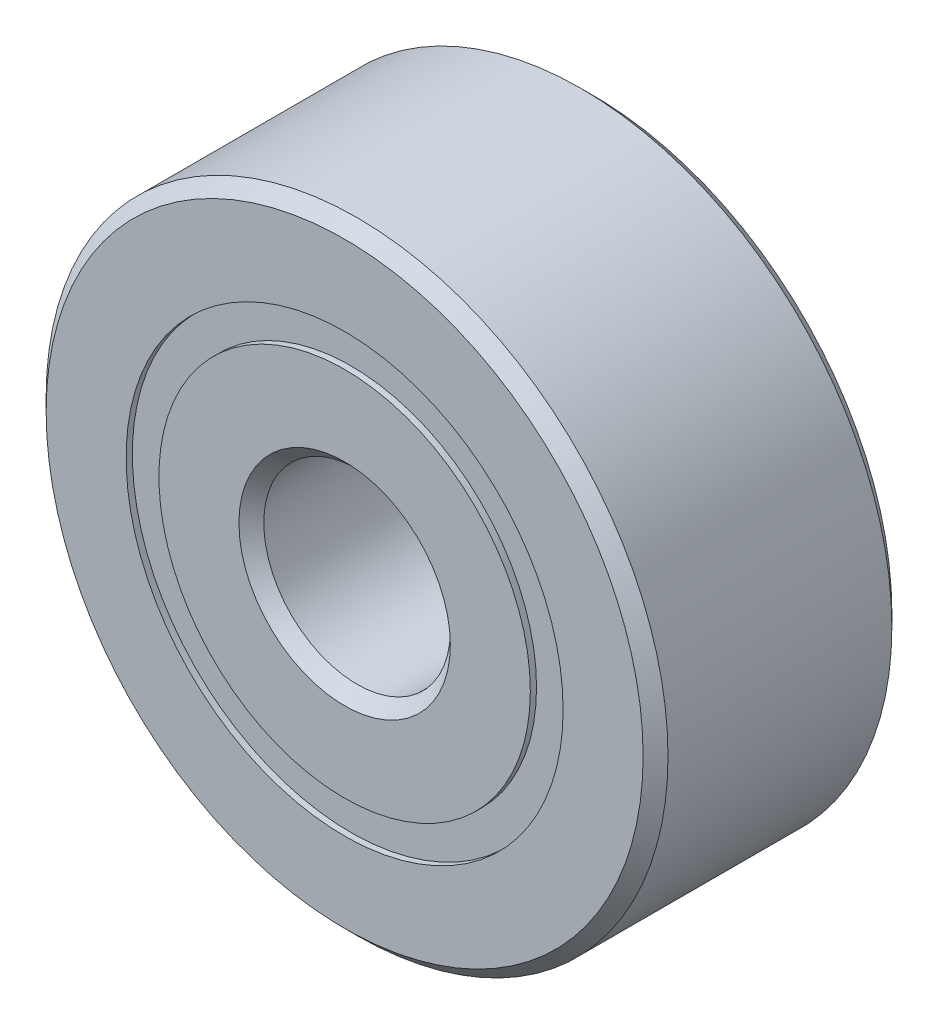
ISO-10303-21;
HEADER;
FILE_DESCRIPTION(('STEP AP214'),'2;1');
FILE_NAME('part.step','',(''),(''),'','','');
FILE_SCHEMA(('AUTOMOTIVE_DESIGN { 1 0 10303 214 1 1 1 1 }'));
ENDSEC;
DATA;
#1=APPLICATION_CONTEXT('core data for automotive mechanical design processes');
#2=APPLICATION_PROTOCOL_DEFINITION('international standard','automotive_design',2000,#1);
#3=PRODUCT_CONTEXT('',#1,'mechanical');
#4=PRODUCT('Part','Part','',(#3));
#5=PRODUCT_RELATED_PRODUCT_CATEGORY('part','',(#4));
#6=PRODUCT_DEFINITION_FORMATION('','',#4);
#7=PRODUCT_DEFINITION_CONTEXT('part definition',#1,'design');
#8=PRODUCT_DEFINITION('design','',#6,#7);
#9=PRODUCT_DEFINITION_SHAPE('','',#8);
#10=(LENGTH_UNIT() NAMED_UNIT(*) SI_UNIT(.MILLI.,.METRE.));
#11=(NAMED_UNIT(*) PLANE_ANGLE_UNIT() SI_UNIT($,.RADIAN.));
#12=(NAMED_UNIT(*) SI_UNIT($,.STERADIAN.) SOLID_ANGLE_UNIT());
#13=UNCERTAINTY_MEASURE_WITH_UNIT(LENGTH_MEASURE(1.E-05),#10,'distance_accuracy_value','');
#14=(GEOMETRIC_REPRESENTATION_CONTEXT(3) GLOBAL_UNCERTAINTY_ASSIGNED_CONTEXT((#13)) GLOBAL_UNIT_ASSIGNED_CONTEXT((#10,
#11,#12)) REPRESENTATION_CONTEXT('',''));
#15=CARTESIAN_POINT('',(0.,0.,0.));
#16=DIRECTION('',(0.,0.,1.));
#17=DIRECTION('',(1.,0.,0.));
#18=AXIS2_PLACEMENT_3D('',#15,#16,#17);
#19=CARTESIAN_POINT('',(0.,3.51373626373626,-1.9));
#20=DIRECTION('',(0.,0.,1.));
#21=DIRECTION('',(1.,0.,0.));
#22=AXIS2_PLACEMENT_3D('',#19,#20,#21);
#23=PLANE('',#22);
#24=CARTESIAN_POINT('',(0.,0.,-1.9));
#25=DIRECTION('',(0.,0.,1.));
#26=DIRECTION('',(1.,0.,0.));
#27=AXIS2_PLACEMENT_3D('',#24,#25,#26);
#28=CIRCLE('',#27,3.51373626373626);
#29=CARTESIAN_POINT('',(3.51373626373626,0.,-1.9));
#30=VERTEX_POINT('',#29);
#31=EDGE_CURVE('E61',#30,#30,#28,.T.);
#32=ORIENTED_EDGE('',*,*,#31,.F.);
#33=EDGE_LOOP('',(#32));
#34=FACE_BOUND('',#33,.T.);
#35=CARTESIAN_POINT('',(0.,0.,-1.9));
#36=DIRECTION('',(0.,0.,1.));
#37=DIRECTION('',(1.,0.,0.));
#38=AXIS2_PLACEMENT_3D('',#35,#36,#37);
#39=CIRCLE('',#38,2.98626373626374);
#40=CARTESIAN_POINT('',(2.98626373626374,0.,-1.9));
#41=VERTEX_POINT('',#40);
#42=EDGE_CURVE('E11',#41,#41,#39,.T.);
#43=ORIENTED_EDGE('',*,*,#42,.T.);
#44=EDGE_LOOP('',(#43));
#45=FACE_BOUND('',#44,.T.);
#46=ADVANCED_FACE('F47',(#34,#45),#23,.F.);
#47=CARTESIAN_POINT('',(0.,0.,2.));
#48=DIRECTION('',(0.,0.,1.));
#49=DIRECTION('',(1.,0.,0.));
#50=AXIS2_PLACEMENT_3D('',#47,#48,#49);
#51=CYLINDRICAL_SURFACE('',#50,2.98626373626374);
#52=ORIENTED_EDGE('',*,*,#42,.F.);
#53=EDGE_LOOP('',(#52));
#54=FACE_BOUND('',#53,.T.);
#55=CARTESIAN_POINT('',(0.,0.,-0.927189448602436));
#56=DIRECTION('',(0.,0.,1.));
#57=DIRECTION('',(1.,0.,0.));
#58=AXIS2_PLACEMENT_3D('',#55,#56,#57);
#59=CIRCLE('',#58,2.98626373626374);
#60=CARTESIAN_POINT('',(2.98626373626374,0.,-0.927189448602436));
#61=VERTEX_POINT('',#60);
#62=EDGE_CURVE('E53',#61,#61,#59,.T.);
#63=ORIENTED_EDGE('',*,*,#62,.T.);
#64=EDGE_LOOP('',(#63));
#65=FACE_BOUND('',#64,.T.);
#66=ADVANCED_FACE('F70',(#54,#65),#51,.F.);
#67=CARTESIAN_POINT('',(0.,3.51373626373626,-0.927189448602435));
#68=DIRECTION('',(0.,0.,-1.));
#69=DIRECTION('',(-1.,0.,0.));
#70=AXIS2_PLACEMENT_3D('',#67,#68,#69);
#71=PLANE('',#70);
#72=ORIENTED_EDGE('',*,*,#62,.F.);
#73=EDGE_LOOP('',(#72));
#74=FACE_BOUND('',#73,.T.);
#75=CARTESIAN_POINT('',(0.,0.,-0.927189448602436));
#76=DIRECTION('',(0.,0.,1.));
#77=DIRECTION('',(1.,0.,0.));
#78=AXIS2_PLACEMENT_3D('',#75,#76,#77);
#79=CIRCLE('',#78,3.51373626373626);
#80=CARTESIAN_POINT('',(3.51373626373626,0.,-0.927189448602436));
#81=VERTEX_POINT('',#80);
#82=EDGE_CURVE('E57',#81,#81,#79,.T.);
#83=ORIENTED_EDGE('',*,*,#82,.T.);
#84=EDGE_LOOP('',(#83));
#85=FACE_BOUND('',#84,.T.);
#86=ADVANCED_FACE('F74',(#74,#85),#71,.F.);
#87=CARTESIAN_POINT('',(0.,0.,2.));
#88=DIRECTION('',(0.,0.,1.));
#89=DIRECTION('',(1.,0.,0.));
#90=AXIS2_PLACEMENT_3D('',#87,#88,#89);
#91=CYLINDRICAL_SURFACE('',#90,3.51373626373626);
#92=ORIENTED_EDGE('',*,*,#82,.F.);
#93=EDGE_LOOP('',(#92));
#94=FACE_BOUND('',#93,.T.);
#95=ORIENTED_EDGE('',*,*,#31,.T.);
#96=EDGE_LOOP('',(#95));
#97=FACE_BOUND('',#96,.T.);
#98=ADVANCED_FACE('F67',(#94,#97),#91,.T.);
#99=CLOSED_SHELL('',(#46,#66,#86,#98));
#100=MANIFOLD_SOLID_BREP('B2',#99);
#101=CARTESIAN_POINT('',(0.,3.51373626373626,1.9));
#102=DIRECTION('',(0.,0.,-1.));
#103=DIRECTION('',(-1.,0.,0.));
#104=AXIS2_PLACEMENT_3D('',#101,#102,#103);
#105=PLANE('',#104);
#106=CARTESIAN_POINT('',(0.,0.,1.9));
#107=DIRECTION('',(0.,0.,1.));
#108=DIRECTION('',(1.,0.,0.));
#109=AXIS2_PLACEMENT_3D('',#106,#107,#108);
#110=CIRCLE('',#109,2.98626373626374);
#111=CARTESIAN_POINT('',(2.98626373626374,0.,1.9));
#112=VERTEX_POINT('',#111);
#113=EDGE_CURVE('E46',#112,#112,#110,.T.);
#114=ORIENTED_EDGE('',*,*,#113,.F.);
#115=EDGE_LOOP('',(#114));
#116=FACE_BOUND('',#115,.T.);
#117=CARTESIAN_POINT('',(0.,0.,1.9));
#118=DIRECTION('',(0.,0.,1.));
#119=DIRECTION('',(1.,0.,0.));
#120=AXIS2_PLACEMENT_3D('',#117,#118,#119);
#121=CIRCLE('',#120,3.51373626373626);
#122=CARTESIAN_POINT('',(3.51373626373626,0.,1.9));
#123=VERTEX_POINT('',#122);
#124=EDGE_CURVE('E136',#123,#123,#121,.T.);
#125=ORIENTED_EDGE('',*,*,#124,.T.);
#126=EDGE_LOOP('',(#125));
#127=FACE_BOUND('',#126,.T.);
#128=ADVANCED_FACE('F122',(#116,#127),#105,.F.);
#129=CARTESIAN_POINT('',(0.,0.,2.));
#130=DIRECTION('',(0.,0.,1.));
#131=DIRECTION('',(1.,0.,0.));
#132=AXIS2_PLACEMENT_3D('',#129,#130,#131);
#133=CYLINDRICAL_SURFACE('',#132,2.98626373626374);
#134=CARTESIAN_POINT('',(0.,0.,0.927189448602434));
#135=DIRECTION('',(0.,0.,1.));
#136=DIRECTION('',(1.,0.,0.));
#137=AXIS2_PLACEMENT_3D('',#134,#135,#136);
#138=CIRCLE('',#137,2.98626373626374);
#139=CARTESIAN_POINT('',(2.98626373626374,0.,0.927189448602434));
#140=VERTEX_POINT('',#139);
#141=EDGE_CURVE('E128',#140,#140,#138,.T.);
#142=ORIENTED_EDGE('',*,*,#141,.F.);
#143=EDGE_LOOP('',(#142));
#144=FACE_BOUND('',#143,.T.);
#145=ORIENTED_EDGE('',*,*,#113,.T.);
#146=EDGE_LOOP('',(#145));
#147=FACE_BOUND('',#146,.T.);
#148=ADVANCED_FACE('F151',(#144,#147),#133,.F.);
#149=CARTESIAN_POINT('',(0.,3.51373626373626,0.927189448602434));
#150=DIRECTION('',(0.,0.,1.));
#151=DIRECTION('',(1.,0.,0.));
#152=AXIS2_PLACEMENT_3D('',#149,#150,#151);
#153=PLANE('',#152);
#154=CARTESIAN_POINT('',(0.,0.,0.927189448602434));
#155=DIRECTION('',(0.,0.,1.));
#156=DIRECTION('',(1.,0.,0.));
#157=AXIS2_PLACEMENT_3D('',#154,#155,#156);
#158=CIRCLE('',#157,3.51373626373626);
#159=CARTESIAN_POINT('',(3.51373626373626,0.,0.927189448602434));
#160=VERTEX_POINT('',#159);
#161=EDGE_CURVE('E132',#160,#160,#158,.T.);
#162=ORIENTED_EDGE('',*,*,#161,.F.);
#163=EDGE_LOOP('',(#162));
#164=FACE_BOUND('',#163,.T.);
#165=ORIENTED_EDGE('',*,*,#141,.T.);
#166=EDGE_LOOP('',(#165));
#167=FACE_BOUND('',#166,.T.);
#168=ADVANCED_FACE('F146',(#164,#167),#153,.F.);
#169=CARTESIAN_POINT('',(0.,0.,2.));
#170=DIRECTION('',(0.,0.,1.));
#171=DIRECTION('',(1.,0.,0.));
#172=AXIS2_PLACEMENT_3D('',#169,#170,#171);
#173=CYLINDRICAL_SURFACE('',#172,3.51373626373626);
#174=ORIENTED_EDGE('',*,*,#124,.F.);
#175=EDGE_LOOP('',(#174));
#176=FACE_BOUND('',#175,.T.);
#177=ORIENTED_EDGE('',*,*,#161,.T.);
#178=EDGE_LOOP('',(#177));
#179=FACE_BOUND('',#178,.T.);
#180=ADVANCED_FACE('F143',(#176,#179),#173,.T.);
#181=CLOSED_SHELL('',(#128,#148,#168,#180));
#182=MANIFOLD_SOLID_BREP('B6',#181);
#183=CARTESIAN_POINT('',(-1.62499999999996,2.81458256229945,0.));
#184=DIRECTION('',(0.,0.,1.));
#185=DIRECTION('',(-0.499999999999989,0.866025403784445,0.));
#186=AXIS2_PLACEMENT_3D('',#183,#184,#185);
#187=SPHERICAL_SURFACE('',#186,0.927189448602435);
#188=CARTESIAN_POINT('',(-1.62499999999996,2.81458256229945,0.927189448602434));
#189=VERTEX_POINT('',#188);
#190=VERTEX_LOOP('',#189);
#191=FACE_BOUND('',#190,.T.);
#192=ADVANCED_FACE('F197',(#191),#187,.T.);
#193=CLOSED_SHELL('',(#192));
#194=MANIFOLD_SOLID_BREP('B41',#193);
#195=CARTESIAN_POINT('',(-2.81458256229941,1.62500000000003,0.));
#196=DIRECTION('',(0.,0.,1.));
#197=DIRECTION('',(-0.866025403784433,0.50000000000001,0.));
#198=AXIS2_PLACEMENT_3D('',#195,#196,#197);
#199=SPHERICAL_SURFACE('',#198,0.927189448602435);
#200=CARTESIAN_POINT('',(-2.81458256229941,1.62500000000003,0.927189448602434));
#201=VERTEX_POINT('',#200);
#202=VERTEX_LOOP('',#201);
#203=FACE_BOUND('',#202,.T.);
#204=ADVANCED_FACE('F219',(#203),#199,.T.);
#205=CLOSED_SHELL('',(#204));
#206=MANIFOLD_SOLID_BREP('B118',#205);
#207=CARTESIAN_POINT('',(-3.25,0.,0.));
#208=DIRECTION('',(0.,0.,1.));
#209=DIRECTION('',(-1.,0.,0.));
#210=AXIS2_PLACEMENT_3D('',#207,#208,#209);
#211=SPHERICAL_SURFACE('',#210,0.927189448602435);
#212=CARTESIAN_POINT('',(-3.25,0.,0.927189448602434));
#213=VERTEX_POINT('',#212);
#214=VERTEX_LOOP('',#213);
#215=FACE_BOUND('',#214,.T.);
#216=ADVANCED_FACE('F241',(#215),#211,.T.);
#217=CLOSED_SHELL('',(#216));
#218=MANIFOLD_SOLID_BREP('B193',#217);
#219=CARTESIAN_POINT('',(-2.81458256229944,-1.62499999999997,0.));
#220=DIRECTION('',(0.,0.,1.));
#221=DIRECTION('',(-0.866025403784443,-0.499999999999992,0.));
#222=AXIS2_PLACEMENT_3D('',#219,#220,#221);
#223=SPHERICAL_SURFACE('',#222,0.927189448602435);
#224=CARTESIAN_POINT('',(-2.81458256229944,-1.62499999999997,0.927189448602434));
#225=VERTEX_POINT('',#224);
#226=VERTEX_LOOP('',#225);
#227=FACE_BOUND('',#226,.T.);
#228=ADVANCED_FACE('F263',(#227),#223,.T.);
#229=CLOSED_SHELL('',(#228));
#230=MANIFOLD_SOLID_BREP('B215',#229);
#231=CARTESIAN_POINT('',(-1.62500000000002,-2.81458256229941,0.));
#232=DIRECTION('',(0.,0.,1.));
#233=DIRECTION('',(-0.500000000000007,-0.866025403784435,0.));
#234=AXIS2_PLACEMENT_3D('',#231,#232,#233);
#235=SPHERICAL_SURFACE('',#234,0.927189448602435);
#236=CARTESIAN_POINT('',(-1.62500000000002,-2.81458256229941,0.927189448602434));
#237=VERTEX_POINT('',#236);
#238=VERTEX_LOOP('',#237);
#239=FACE_BOUND('',#238,.T.);
#240=ADVANCED_FACE('F285',(#239),#235,.T.);
#241=CLOSED_SHELL('',(#240));
#242=MANIFOLD_SOLID_BREP('B237',#241);
#243=CARTESIAN_POINT('',(0.,-3.25,0.));
#244=DIRECTION('',(0.,0.,1.));
#245=DIRECTION('',(0.,-1.,0.));
#246=AXIS2_PLACEMENT_3D('',#243,#244,#245);
#247=SPHERICAL_SURFACE('',#246,0.927189448602435);
#248=CARTESIAN_POINT('',(0.,-3.25,0.927189448602434));
#249=VERTEX_POINT('',#248);
#250=VERTEX_LOOP('',#249);
#251=FACE_BOUND('',#250,.T.);
#252=ADVANCED_FACE('F307',(#251),#247,.T.);
#253=CLOSED_SHELL('',(#252));
#254=MANIFOLD_SOLID_BREP('B259',#253);
#255=CARTESIAN_POINT('',(1.62499999999998,-2.81458256229944,0.));
#256=DIRECTION('',(0.,0.,1.));
#257=DIRECTION('',(0.499999999999995,-0.866025403784442,0.));
#258=AXIS2_PLACEMENT_3D('',#255,#256,#257);
#259=SPHERICAL_SURFACE('',#258,0.927189448602435);
#260=CARTESIAN_POINT('',(1.62499999999998,-2.81458256229944,0.927189448602434));
#261=VERTEX_POINT('',#260);
#262=VERTEX_LOOP('',#261);
#263=FACE_BOUND('',#262,.T.);
#264=ADVANCED_FACE('F329',(#263),#259,.T.);
#265=CLOSED_SHELL('',(#264));
#266=MANIFOLD_SOLID_BREP('B281',#265);
#267=CARTESIAN_POINT('',(2.81458256229942,-1.62500000000001,0.));
#268=DIRECTION('',(0.,0.,1.));
#269=DIRECTION('',(0.866025403784436,-0.500000000000004,0.));
#270=AXIS2_PLACEMENT_3D('',#267,#268,#269);
#271=SPHERICAL_SURFACE('',#270,0.927189448602435);
#272=CARTESIAN_POINT('',(2.81458256229942,-1.62500000000001,0.927189448602434));
#273=VERTEX_POINT('',#272);
#274=VERTEX_LOOP('',#273);
#275=FACE_BOUND('',#274,.T.);
#276=ADVANCED_FACE('F351',(#275),#271,.T.);
#277=CLOSED_SHELL('',(#276));
#278=MANIFOLD_SOLID_BREP('B303',#277);
#279=CARTESIAN_POINT('',(3.25,0.,0.));
#280=DIRECTION('',(0.,0.,1.));
#281=DIRECTION('',(1.,0.,0.));
#282=AXIS2_PLACEMENT_3D('',#279,#280,#281);
#283=SPHERICAL_SURFACE('',#282,0.927189448602435);
#284=CARTESIAN_POINT('',(3.25,0.,0.927189448602434));
#285=VERTEX_POINT('',#284);
#286=VERTEX_LOOP('',#285);
#287=FACE_BOUND('',#286,.T.);
#288=ADVANCED_FACE('F373',(#287),#283,.T.);
#289=CLOSED_SHELL('',(#288));
#290=MANIFOLD_SOLID_BREP('B325',#289);
#291=CARTESIAN_POINT('',(2.81458256229943,1.62499999999999,0.));
#292=DIRECTION('',(0.,0.,1.));
#293=DIRECTION('',(0.86602540378444,0.499999999999998,0.));
#294=AXIS2_PLACEMENT_3D('',#291,#292,#293);
#295=SPHERICAL_SURFACE('',#294,0.927189448602435);
#296=CARTESIAN_POINT('',(2.81458256229943,1.62499999999999,0.927189448602434));
#297=VERTEX_POINT('',#296);
#298=VERTEX_LOOP('',#297);
#299=FACE_BOUND('',#298,.T.);
#300=ADVANCED_FACE('F395',(#299),#295,.T.);
#301=CLOSED_SHELL('',(#300));
#302=MANIFOLD_SOLID_BREP('B347',#301);
#303=CARTESIAN_POINT('',(1.625,2.81458256229942,0.));
#304=DIRECTION('',(0.,0.,1.));
#305=DIRECTION('',(0.500000000000001,0.866025403784438,0.));
#306=AXIS2_PLACEMENT_3D('',#303,#304,#305);
#307=SPHERICAL_SURFACE('',#306,0.927189448602435);
#308=CARTESIAN_POINT('',(1.625,2.81458256229942,0.927189448602434));
#309=VERTEX_POINT('',#308);
#310=VERTEX_LOOP('',#309);
#311=FACE_BOUND('',#310,.T.);
#312=ADVANCED_FACE('F417',(#311),#307,.T.);
#313=CLOSED_SHELL('',(#312));
#314=MANIFOLD_SOLID_BREP('B369',#313);
#315=CARTESIAN_POINT('',(0.,3.25,0.));
#316=DIRECTION('',(0.,0.,1.));
#317=DIRECTION('',(0.,1.,0.));
#318=AXIS2_PLACEMENT_3D('',#315,#316,#317);
#319=SPHERICAL_SURFACE('',#318,0.927189448602435);
#320=CARTESIAN_POINT('',(0.,3.25,0.927189448602434));
#321=VERTEX_POINT('',#320);
#322=VERTEX_LOOP('',#321);
#323=FACE_BOUND('',#322,.T.);
#324=ADVANCED_FACE('F441',(#323),#319,.T.);
#325=CLOSED_SHELL('',(#324));
#326=MANIFOLD_SOLID_BREP('B391',#325);
#327=CARTESIAN_POINT('',(0.,2.98626373626374,2.));
#328=DIRECTION('',(0.,0.,-1.));
#329=DIRECTION('',(-1.,0.,0.));
#330=AXIS2_PLACEMENT_3D('',#327,#328,#329);
#331=PLANE('',#330);
#332=CARTESIAN_POINT('',(0.,0.,2.));
#333=DIRECTION('',(0.,0.,1.));
#334=DIRECTION('',(1.,0.,0.));
#335=AXIS2_PLACEMENT_3D('',#332,#333,#334);
#336=CIRCLE('',#335,1.7);
#337=CARTESIAN_POINT('',(1.7,0.,2.));
#338=VERTEX_POINT('',#337);
#339=EDGE_CURVE('E490',#338,#338,#336,.T.);
#340=ORIENTED_EDGE('',*,*,#339,.F.);
#341=EDGE_LOOP('',(#340));
#342=FACE_BOUND('',#341,.T.);
#343=CARTESIAN_POINT('',(0.,0.,2.));
#344=DIRECTION('',(0.,0.,1.));
#345=DIRECTION('',(1.,0.,0.));
#346=AXIS2_PLACEMENT_3D('',#343,#344,#345);
#347=CIRCLE('',#346,2.98626373626374);
#348=CARTESIAN_POINT('',(2.98626373626374,0.,2.));
#349=VERTEX_POINT('',#348);
#350=EDGE_CURVE('E440',#349,#349,#347,.T.);
#351=ORIENTED_EDGE('',*,*,#350,.T.);
#352=EDGE_LOOP('',(#351));
#353=FACE_BOUND('',#352,.T.);
#354=ADVANCED_FACE('F462',(#342,#353),#331,.F.);
#355=CARTESIAN_POINT('',(0.,0.,2.));
#356=DIRECTION('',(0.,0.,1.));
#357=DIRECTION('',(1.,0.,0.));
#358=AXIS2_PLACEMENT_3D('',#355,#356,#357);
#359=CYLINDRICAL_SURFACE('',#358,2.98626373626374);
#360=ORIENTED_EDGE('',*,*,#350,.F.);
#361=EDGE_LOOP('',(#360));
#362=FACE_BOUND('',#361,.T.);
#363=CARTESIAN_POINT('',(0.,0.,0.888888888888888));
#364=DIRECTION('',(0.,0.,1.));
#365=DIRECTION('',(1.,0.,0.));
#366=AXIS2_PLACEMENT_3D('',#363,#364,#365);
#367=CIRCLE('',#366,2.98626373626374);
#368=CARTESIAN_POINT('',(2.98626373626374,0.,0.888888888888888));
#369=VERTEX_POINT('',#368);
#370=EDGE_CURVE('E468',#369,#369,#367,.T.);
#371=ORIENTED_EDGE('',*,*,#370,.T.);
#372=EDGE_LOOP('',(#371));
#373=FACE_BOUND('',#372,.T.);
#374=ADVANCED_FACE('F497',(#362,#373),#359,.T.);
#375=CARTESIAN_POINT('',(0.,0.,0.));
#376=DIRECTION('',(0.,0.,1.));
#377=DIRECTION('',(1.,0.,0.));
#378=AXIS2_PLACEMENT_3D('',#375,#376,#377);
#379=TOROIDAL_SURFACE('',#378,3.25,0.927189448602433);
#380=ORIENTED_EDGE('',*,*,#370,.F.);
#381=EDGE_LOOP('',(#380));
#382=FACE_BOUND('',#381,.T.);
#383=CARTESIAN_POINT('',(0.,0.,-0.88888888888889));
#384=DIRECTION('',(0.,0.,1.));
#385=DIRECTION('',(1.,0.,0.));
#386=AXIS2_PLACEMENT_3D('',#383,#384,#385);
#387=CIRCLE('',#386,2.98626373626374);
#388=CARTESIAN_POINT('',(2.98626373626374,0.,-0.88888888888889));
#389=VERTEX_POINT('',#388);
#390=EDGE_CURVE('E472',#389,#389,#387,.T.);
#391=ORIENTED_EDGE('',*,*,#390,.T.);
#392=EDGE_LOOP('',(#391));
#393=FACE_BOUND('',#392,.T.);
#394=ADVANCED_FACE('F501',(#382,#393),#379,.F.);
#395=CARTESIAN_POINT('',(0.,0.,2.));
#396=DIRECTION('',(0.,0.,1.));
#397=DIRECTION('',(1.,0.,0.));
#398=AXIS2_PLACEMENT_3D('',#395,#396,#397);
#399=CYLINDRICAL_SURFACE('',#398,2.98626373626374);
#400=ORIENTED_EDGE('',*,*,#390,.F.);
#401=EDGE_LOOP('',(#400));
#402=FACE_BOUND('',#401,.T.);
#403=CARTESIAN_POINT('',(0.,0.,-2.));
#404=DIRECTION('',(0.,0.,1.));
#405=DIRECTION('',(1.,0.,0.));
#406=AXIS2_PLACEMENT_3D('',#403,#404,#405);
#407=CIRCLE('',#406,2.98626373626374);
#408=CARTESIAN_POINT('',(2.98626373626374,0.,-2.));
#409=VERTEX_POINT('',#408);
#410=EDGE_CURVE('E476',#409,#409,#407,.T.);
#411=ORIENTED_EDGE('',*,*,#410,.T.);
#412=EDGE_LOOP('',(#411));
#413=FACE_BOUND('',#412,.T.);
#414=ADVANCED_FACE('F506',(#402,#413),#399,.T.);
#415=CARTESIAN_POINT('',(0.,1.7,-2.));
#416=DIRECTION('',(0.,0.,1.));
#417=DIRECTION('',(1.,0.,0.));
#418=AXIS2_PLACEMENT_3D('',#415,#416,#417);
#419=PLANE('',#418);
#420=ORIENTED_EDGE('',*,*,#410,.F.);
#421=EDGE_LOOP('',(#420));
#422=FACE_BOUND('',#421,.T.);
#423=CARTESIAN_POINT('',(0.,0.,-2.));
#424=DIRECTION('',(0.,0.,1.));
#425=DIRECTION('',(1.,0.,0.));
#426=AXIS2_PLACEMENT_3D('',#423,#424,#425);
#427=CIRCLE('',#426,1.7);
#428=CARTESIAN_POINT('',(1.7,0.,-2.));
#429=VERTEX_POINT('',#428);
#430=EDGE_CURVE('E481',#429,#429,#427,.T.);
#431=ORIENTED_EDGE('',*,*,#430,.T.);
#432=EDGE_LOOP('',(#431));
#433=FACE_BOUND('',#432,.T.);
#434=ADVANCED_FACE('F512',(#422,#433),#419,.F.);
#435=CARTESIAN_POINT('',(0.,0.,-1.8));
#436=DIRECTION('',(0.,0.,-1.));
#437=DIRECTION('',(-1.,0.,0.));
#438=AXIS2_PLACEMENT_3D('',#435,#436,#437);
#439=CONICAL_SURFACE('',#438,1.5,0.785398163397443);
#440=ORIENTED_EDGE('',*,*,#430,.F.);
#441=EDGE_LOOP('',(#440));
#442=FACE_BOUND('',#441,.T.);
#443=CARTESIAN_POINT('',(0.,0.,-1.8));
#444=DIRECTION('',(0.,0.,1.));
#445=DIRECTION('',(1.,0.,0.));
#446=AXIS2_PLACEMENT_3D('',#443,#444,#445);
#447=CIRCLE('',#446,1.5);
#448=CARTESIAN_POINT('',(1.5,0.,-1.8));
#449=VERTEX_POINT('',#448);
#450=EDGE_CURVE('E484',#449,#449,#447,.T.);
#451=ORIENTED_EDGE('',*,*,#450,.T.);
#452=EDGE_LOOP('',(#451));
#453=FACE_BOUND('',#452,.T.);
#454=ADVANCED_FACE('F516',(#442,#453),#439,.F.);
#455=CARTESIAN_POINT('',(0.,0.,2.));
#456=DIRECTION('',(0.,0.,1.));
#457=DIRECTION('',(1.,0.,0.));
#458=AXIS2_PLACEMENT_3D('',#455,#456,#457);
#459=CYLINDRICAL_SURFACE('',#458,1.5);
#460=ORIENTED_EDGE('',*,*,#450,.F.);
#461=EDGE_LOOP('',(#460));
#462=FACE_BOUND('',#461,.T.);
#463=CARTESIAN_POINT('',(0.,0.,1.8));
#464=DIRECTION('',(0.,0.,1.));
#465=DIRECTION('',(1.,0.,0.));
#466=AXIS2_PLACEMENT_3D('',#463,#464,#465);
#467=CIRCLE('',#466,1.5);
#468=CARTESIAN_POINT('',(1.5,0.,1.8));
#469=VERTEX_POINT('',#468);
#470=EDGE_CURVE('E487',#469,#469,#467,.T.);
#471=ORIENTED_EDGE('',*,*,#470,.T.);
#472=EDGE_LOOP('',(#471));
#473=FACE_BOUND('',#472,.T.);
#474=ADVANCED_FACE('F520',(#462,#473),#459,.F.);
#475=CARTESIAN_POINT('',(0.,0.,2.));
#476=DIRECTION('',(0.,0.,1.));
#477=DIRECTION('',(1.,0.,0.));
#478=AXIS2_PLACEMENT_3D('',#475,#476,#477);
#479=CONICAL_SURFACE('',#478,1.7,0.785398163397454);
#480=ORIENTED_EDGE('',*,*,#470,.F.);
#481=EDGE_LOOP('',(#480));
#482=FACE_BOUND('',#481,.T.);
#483=ORIENTED_EDGE('',*,*,#339,.T.);
#484=EDGE_LOOP('',(#483));
#485=FACE_BOUND('',#484,.T.);
#486=ADVANCED_FACE('F494',(#482,#485),#479,.F.);
#487=CLOSED_SHELL('',(#354,#374,#394,#414,#434,#454,#474,#486));
#488=MANIFOLD_SOLID_BREP('B413',#487);
#489=CARTESIAN_POINT('',(0.,0.,1.8));
#490=DIRECTION('',(0.,0.,-1.));
#491=DIRECTION('',(-1.,0.,0.));
#492=AXIS2_PLACEMENT_3D('',#489,#490,#491);
#493=CONICAL_SURFACE('',#492,5.,0.785398163397445);
#494=CARTESIAN_POINT('',(0.,0.,2.));
#495=DIRECTION('',(0.,0.,1.));
#496=DIRECTION('',(1.,0.,0.));
#497=AXIS2_PLACEMENT_3D('',#494,#495,#496);
#498=CIRCLE('',#497,4.8);
#499=CARTESIAN_POINT('',(4.8,0.,2.));
#500=VERTEX_POINT('',#499);
#501=EDGE_CURVE('E627',#500,#500,#498,.T.);
#502=ORIENTED_EDGE('',*,*,#501,.F.);
#503=EDGE_LOOP('',(#502));
#504=FACE_BOUND('',#503,.T.);
#505=CARTESIAN_POINT('',(0.,0.,1.8));
#506=DIRECTION('',(0.,0.,1.));
#507=DIRECTION('',(1.,0.,0.));
#508=AXIS2_PLACEMENT_3D('',#505,#506,#507);
#509=CIRCLE('',#508,5.);
#510=CARTESIAN_POINT('',(5.,0.,1.8));
#511=VERTEX_POINT('',#510);
#512=EDGE_CURVE('E461',#511,#511,#509,.T.);
#513=ORIENTED_EDGE('',*,*,#512,.T.);
#514=EDGE_LOOP('',(#513));
#515=FACE_BOUND('',#514,.T.);
#516=ADVANCED_FACE('F599',(#504,#515),#493,.T.);
#517=CARTESIAN_POINT('',(0.,0.,2.));
#518=DIRECTION('',(0.,0.,1.));
#519=DIRECTION('',(1.,0.,0.));
#520=AXIS2_PLACEMENT_3D('',#517,#518,#519);
#521=CYLINDRICAL_SURFACE('',#520,5.);
#522=ORIENTED_EDGE('',*,*,#512,.F.);
#523=EDGE_LOOP('',(#522));
#524=FACE_BOUND('',#523,.T.);
#525=CARTESIAN_POINT('',(0.,0.,-1.8));
#526=DIRECTION('',(0.,0.,1.));
#527=DIRECTION('',(1.,0.,0.));
#528=AXIS2_PLACEMENT_3D('',#525,#526,#527);
#529=CIRCLE('',#528,5.);
#530=CARTESIAN_POINT('',(5.,0.,-1.8));
#531=VERTEX_POINT('',#530);
#532=EDGE_CURVE('E605',#531,#531,#529,.T.);
#533=ORIENTED_EDGE('',*,*,#532,.T.);
#534=EDGE_LOOP('',(#533));
#535=FACE_BOUND('',#534,.T.);
#536=ADVANCED_FACE('F634',(#524,#535),#521,.T.);
#537=CARTESIAN_POINT('',(0.,0.,-2.));
#538=DIRECTION('',(0.,0.,1.));
#539=DIRECTION('',(1.,0.,0.));
#540=AXIS2_PLACEMENT_3D('',#537,#538,#539);
#541=CONICAL_SURFACE('',#540,4.8,0.785398163397444);
#542=ORIENTED_EDGE('',*,*,#532,.F.);
#543=EDGE_LOOP('',(#542));
#544=FACE_BOUND('',#543,.T.);
#545=CARTESIAN_POINT('',(0.,0.,-2.));
#546=DIRECTION('',(0.,0.,1.));
#547=DIRECTION('',(1.,0.,0.));
#548=AXIS2_PLACEMENT_3D('',#545,#546,#547);
#549=CIRCLE('',#548,4.8);
#550=CARTESIAN_POINT('',(4.8,0.,-2.));
#551=VERTEX_POINT('',#550);
#552=EDGE_CURVE('E609',#551,#551,#549,.T.);
#553=ORIENTED_EDGE('',*,*,#552,.T.);
#554=EDGE_LOOP('',(#553));
#555=FACE_BOUND('',#554,.T.);
#556=ADVANCED_FACE('F638',(#544,#555),#541,.T.);
#557=CARTESIAN_POINT('',(0.,4.8,-2.));
#558=DIRECTION('',(0.,0.,1.));
#559=DIRECTION('',(1.,0.,0.));
#560=AXIS2_PLACEMENT_3D('',#557,#558,#559);
#561=PLANE('',#560);
#562=ORIENTED_EDGE('',*,*,#552,.F.);
#563=EDGE_LOOP('',(#562));
#564=FACE_BOUND('',#563,.T.);
#565=CARTESIAN_POINT('',(0.,0.,-2.));
#566=DIRECTION('',(0.,0.,1.));
#567=DIRECTION('',(1.,0.,0.));
#568=AXIS2_PLACEMENT_3D('',#565,#566,#567);
#569=CIRCLE('',#568,3.51373626373626);
#570=CARTESIAN_POINT('',(3.51373626373626,0.,-2.));
#571=VERTEX_POINT('',#570);
#572=EDGE_CURVE('E613',#571,#571,#569,.T.);
#573=ORIENTED_EDGE('',*,*,#572,.T.);
#574=EDGE_LOOP('',(#573));
#575=FACE_BOUND('',#574,.T.);
#576=ADVANCED_FACE('F643',(#564,#575),#561,.F.);
#577=CARTESIAN_POINT('',(0.,0.,2.));
#578=DIRECTION('',(0.,0.,1.));
#579=DIRECTION('',(1.,0.,0.));
#580=AXIS2_PLACEMENT_3D('',#577,#578,#579);
#581=CYLINDRICAL_SURFACE('',#580,3.51373626373626);
#582=ORIENTED_EDGE('',*,*,#572,.F.);
#583=EDGE_LOOP('',(#582));
#584=FACE_BOUND('',#583,.T.);
#585=CARTESIAN_POINT('',(0.,0.,-0.88888888888889));
#586=DIRECTION('',(0.,0.,1.));
#587=DIRECTION('',(1.,0.,0.));
#588=AXIS2_PLACEMENT_3D('',#585,#586,#587);
#589=CIRCLE('',#588,3.51373626373626);
#590=CARTESIAN_POINT('',(3.51373626373626,0.,-0.88888888888889));
#591=VERTEX_POINT('',#590);
#592=EDGE_CURVE('E618',#591,#591,#589,.T.);
#593=ORIENTED_EDGE('',*,*,#592,.T.);
#594=EDGE_LOOP('',(#593));
#595=FACE_BOUND('',#594,.T.);
#596=ADVANCED_FACE('F649',(#584,#595),#581,.F.);
#597=CARTESIAN_POINT('',(0.,0.,0.));
#598=DIRECTION('',(0.,0.,1.));
#599=DIRECTION('',(1.,0.,0.));
#600=AXIS2_PLACEMENT_3D('',#597,#598,#599);
#601=TOROIDAL_SURFACE('',#600,3.25,0.927189448602435);
#602=ORIENTED_EDGE('',*,*,#592,.F.);
#603=EDGE_LOOP('',(#602));
#604=FACE_BOUND('',#603,.T.);
#605=CARTESIAN_POINT('',(0.,0.,0.888888888888888));
#606=DIRECTION('',(0.,0.,1.));
#607=DIRECTION('',(1.,0.,0.));
#608=AXIS2_PLACEMENT_3D('',#605,#606,#607);
#609=CIRCLE('',#608,3.51373626373626);
#610=CARTESIAN_POINT('',(3.51373626373626,0.,0.888888888888888));
#611=VERTEX_POINT('',#610);
#612=EDGE_CURVE('E621',#611,#611,#609,.T.);
#613=ORIENTED_EDGE('',*,*,#612,.T.);
#614=EDGE_LOOP('',(#613));
#615=FACE_BOUND('',#614,.T.);
#616=ADVANCED_FACE('F653',(#604,#615),#601,.F.);
#617=CARTESIAN_POINT('',(0.,0.,2.));
#618=DIRECTION('',(0.,0.,1.));
#619=DIRECTION('',(1.,0.,0.));
#620=AXIS2_PLACEMENT_3D('',#617,#618,#619);
#621=CYLINDRICAL_SURFACE('',#620,3.51373626373626);
#622=ORIENTED_EDGE('',*,*,#612,.F.);
#623=EDGE_LOOP('',(#622));
#624=FACE_BOUND('',#623,.T.);
#625=CARTESIAN_POINT('',(0.,0.,2.));
#626=DIRECTION('',(0.,0.,1.));
#627=DIRECTION('',(1.,0.,0.));
#628=AXIS2_PLACEMENT_3D('',#625,#626,#627);
#629=CIRCLE('',#628,3.51373626373626);
#630=CARTESIAN_POINT('',(3.51373626373626,0.,2.));
#631=VERTEX_POINT('',#630);
#632=EDGE_CURVE('E624',#631,#631,#629,.T.);
#633=ORIENTED_EDGE('',*,*,#632,.T.);
#634=EDGE_LOOP('',(#633));
#635=FACE_BOUND('',#634,.T.);
#636=ADVANCED_FACE('F657',(#624,#635),#621,.F.);
#637=CARTESIAN_POINT('',(0.,4.8,2.));
#638=DIRECTION('',(0.,0.,-1.));
#639=DIRECTION('',(-1.,0.,0.));
#640=AXIS2_PLACEMENT_3D('',#637,#638,#639);
#641=PLANE('',#640);
#642=ORIENTED_EDGE('',*,*,#632,.F.);
#643=EDGE_LOOP('',(#642));
#644=FACE_BOUND('',#643,.T.);
#645=ORIENTED_EDGE('',*,*,#501,.T.);
#646=EDGE_LOOP('',(#645));
#647=FACE_BOUND('',#646,.T.);
#648=ADVANCED_FACE('F631',(#644,#647),#641,.F.);
#649=CLOSED_SHELL('',(#516,#536,#556,#576,#596,#616,#636,#648));
#650=MANIFOLD_SOLID_BREP('B435',#649);
#651=ADVANCED_BREP_SHAPE_REPRESENTATION('',(#18,#100,#182,#194,#206,#218,#230,#242,#254,#266,
#278,#290,#302,#314,#326,#488,#650),#14);
#652=SHAPE_DEFINITION_REPRESENTATION(#9,#651);
ENDSEC;
END-ISO-10303-21;
